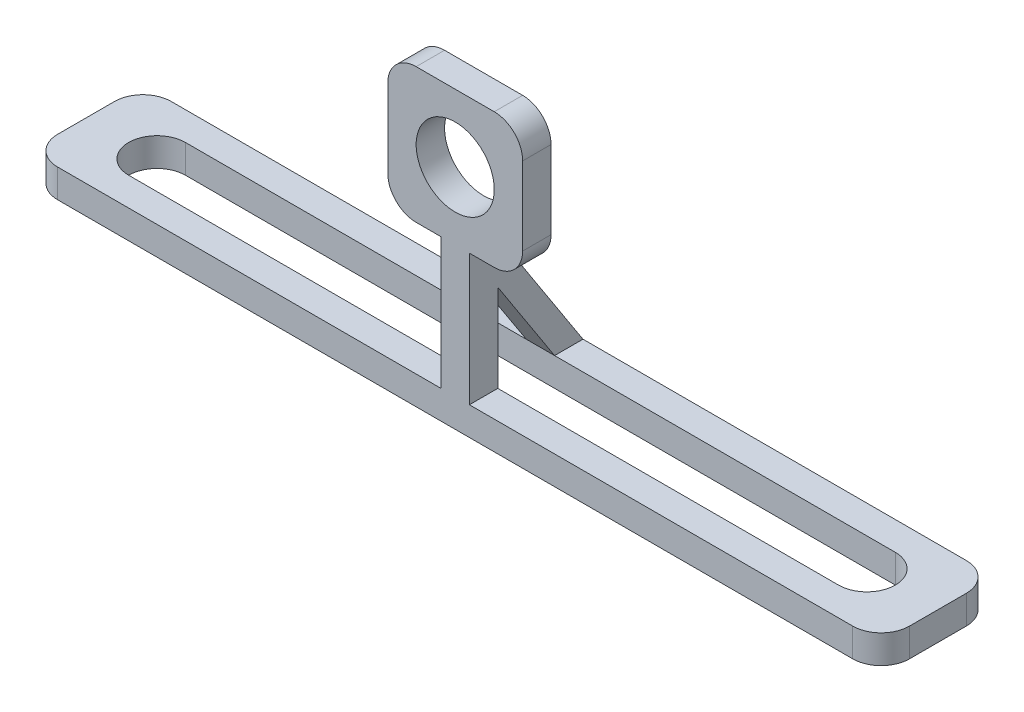
ISO-10303-21;
HEADER;
FILE_DESCRIPTION(('STEP AP214'),'2;1');
FILE_NAME('part.step','',(''),(''),'','','');
FILE_SCHEMA(('AUTOMOTIVE_DESIGN { 1 0 10303 214 1 1 1 1 }'));
ENDSEC;
DATA;
#1=APPLICATION_CONTEXT('core data for automotive mechanical design processes');
#2=APPLICATION_PROTOCOL_DEFINITION('international standard','automotive_design',2000,#1);
#3=PRODUCT_CONTEXT('',#1,'mechanical');
#4=PRODUCT('Part','Part','',(#3));
#5=PRODUCT_RELATED_PRODUCT_CATEGORY('part','',(#4));
#6=PRODUCT_DEFINITION_FORMATION('','',#4);
#7=PRODUCT_DEFINITION_CONTEXT('part definition',#1,'design');
#8=PRODUCT_DEFINITION('design','',#6,#7);
#9=PRODUCT_DEFINITION_SHAPE('','',#8);
#10=(LENGTH_UNIT() NAMED_UNIT(*) SI_UNIT(.MILLI.,.METRE.));
#11=(NAMED_UNIT(*) PLANE_ANGLE_UNIT() SI_UNIT($,.RADIAN.));
#12=(NAMED_UNIT(*) SI_UNIT($,.STERADIAN.) SOLID_ANGLE_UNIT());
#13=UNCERTAINTY_MEASURE_WITH_UNIT(LENGTH_MEASURE(1.E-05),#10,'distance_accuracy_value','');
#14=(GEOMETRIC_REPRESENTATION_CONTEXT(3) GLOBAL_UNCERTAINTY_ASSIGNED_CONTEXT((#13)) GLOBAL_UNIT_ASSIGNED_CONTEXT((#10,
#11,#12)) REPRESENTATION_CONTEXT('',''));
#15=CARTESIAN_POINT('',(0.,0.,0.));
#16=DIRECTION('',(0.,0.,1.));
#17=DIRECTION('',(1.,0.,0.));
#18=AXIS2_PLACEMENT_3D('',#15,#16,#17);
#19=CARTESIAN_POINT('',(0.,20.75,-1.99999999999999));
#20=DIRECTION('',(0.,0.,-1.));
#21=DIRECTION('',(-1.,0.,0.));
#22=AXIS2_PLACEMENT_3D('',#19,#20,#21);
#23=PLANE('',#22);
#24=DIRECTION('',(1.,0.,0.));
#25=VECTOR('',#24,1.);
#26=CARTESIAN_POINT('',(-1.,11.25,-1.99999999999999));
#27=LINE('',#26,#25);
#28=CARTESIAN_POINT('',(-1.,11.25,-1.99999999999999));
#29=VERTEX_POINT('',#28);
#30=CARTESIAN_POINT('',(1.,11.25,-1.99999999999999));
#31=VERTEX_POINT('',#30);
#32=EDGE_CURVE('E285',#29,#31,#27,.T.);
#33=ORIENTED_EDGE('',*,*,#32,.F.);
#34=DIRECTION('',(1.,0.,0.));
#35=VECTOR('',#34,1.);
#36=CARTESIAN_POINT('',(0.,11.25,-1.99999999999999));
#37=LINE('',#36,#35);
#38=CARTESIAN_POINT('',(-2.75,11.25,-1.99999999999999));
#39=VERTEX_POINT('',#38);
#40=EDGE_CURVE('E274',#39,#29,#37,.T.);
#41=ORIENTED_EDGE('',*,*,#40,.F.);
#42=CARTESIAN_POINT('',(-2.75,13.25,-1.99999999999999));
#43=DIRECTION('',(0.,0.,-1.));
#44=DIRECTION('',(-1.,0.,0.));
#45=AXIS2_PLACEMENT_3D('',#42,#43,#44);
#46=CIRCLE('',#45,2.);
#47=CARTESIAN_POINT('',(-4.75,13.25,-1.99999999999999));
#48=VERTEX_POINT('',#47);
#49=EDGE_CURVE('E442',#39,#48,#46,.T.);
#50=ORIENTED_EDGE('',*,*,#49,.T.);
#51=DIRECTION('',(0.,-1.,0.));
#52=VECTOR('',#51,1.);
#53=CARTESIAN_POINT('',(-4.75,20.75,-1.99999999999999));
#54=LINE('',#53,#52);
#55=CARTESIAN_POINT('',(-4.75,18.75,-1.99999999999999));
#56=VERTEX_POINT('',#55);
#57=EDGE_CURVE('E352',#56,#48,#54,.T.);
#58=ORIENTED_EDGE('',*,*,#57,.F.);
#59=CARTESIAN_POINT('',(-2.75,18.75,-1.99999999999999));
#60=DIRECTION('',(0.,0.,-1.));
#61=DIRECTION('',(-1.,0.,0.));
#62=AXIS2_PLACEMENT_3D('',#59,#60,#61);
#63=CIRCLE('',#62,2.);
#64=CARTESIAN_POINT('',(-2.75,20.75,-1.99999999999999));
#65=VERTEX_POINT('',#64);
#66=EDGE_CURVE('E438',#56,#65,#63,.T.);
#67=ORIENTED_EDGE('',*,*,#66,.T.);
#68=DIRECTION('',(1.,0.,0.));
#69=VECTOR('',#68,1.);
#70=CARTESIAN_POINT('',(0.,20.75,-1.99999999999999));
#71=LINE('',#70,#69);
#72=CARTESIAN_POINT('',(2.75,20.75,-1.99999999999999));
#73=VERTEX_POINT('',#72);
#74=EDGE_CURVE('E372',#65,#73,#71,.T.);
#75=ORIENTED_EDGE('',*,*,#74,.T.);
#76=CARTESIAN_POINT('',(2.75,18.75,-1.99999999999999));
#77=DIRECTION('',(0.,0.,-1.));
#78=DIRECTION('',(-1.,0.,0.));
#79=AXIS2_PLACEMENT_3D('',#76,#77,#78);
#80=CIRCLE('',#79,2.);
#81=CARTESIAN_POINT('',(4.75,18.75,-1.99999999999999));
#82=VERTEX_POINT('',#81);
#83=EDGE_CURVE('E436',#73,#82,#80,.T.);
#84=ORIENTED_EDGE('',*,*,#83,.T.);
#85=DIRECTION('',(0.,-1.,0.));
#86=VECTOR('',#85,1.);
#87=CARTESIAN_POINT('',(4.75,20.75,-1.99999999999999));
#88=LINE('',#87,#86);
#89=CARTESIAN_POINT('',(4.75,13.25,-1.99999999999999));
#90=VERTEX_POINT('',#89);
#91=EDGE_CURVE('E345',#82,#90,#88,.T.);
#92=ORIENTED_EDGE('',*,*,#91,.T.);
#93=CARTESIAN_POINT('',(2.75,13.25,-1.99999999999999));
#94=DIRECTION('',(0.,0.,-1.));
#95=DIRECTION('',(-1.,0.,0.));
#96=AXIS2_PLACEMENT_3D('',#93,#94,#95);
#97=CIRCLE('',#96,2.);
#98=CARTESIAN_POINT('',(2.75,11.25,-1.99999999999999));
#99=VERTEX_POINT('',#98);
#100=EDGE_CURVE('E440',#90,#99,#97,.T.);
#101=ORIENTED_EDGE('',*,*,#100,.T.);
#102=DIRECTION('',(-1.,0.,0.));
#103=VECTOR('',#102,1.);
#104=CARTESIAN_POINT('',(0.,11.25,-1.99999999999999));
#105=LINE('',#104,#103);
#106=EDGE_CURVE('E288',#99,#31,#105,.T.);
#107=ORIENTED_EDGE('',*,*,#106,.T.);
#108=EDGE_LOOP('',(#33,#41,#50,#58,#67,#75,#84,#92,#101,#107));
#109=FACE_BOUND('',#108,.T.);
#110=CARTESIAN_POINT('',(0.,16.,-1.99999999999999));
#111=DIRECTION('',(0.,0.,-1.));
#112=DIRECTION('',(-1.,0.,0.));
#113=AXIS2_PLACEMENT_3D('',#110,#111,#112);
#114=CIRCLE('',#113,2.75);
#115=CARTESIAN_POINT('',(-2.75,16.,-1.99999999999999));
#116=VERTEX_POINT('',#115);
#117=EDGE_CURVE('E361',#116,#116,#114,.T.);
#118=ORIENTED_EDGE('',*,*,#117,.F.);
#119=EDGE_LOOP('',(#118));
#120=FACE_BOUND('',#119,.T.);
#121=ADVANCED_FACE('F79',(#109,#120),#23,.T.);
#122=CARTESIAN_POINT('',(0.,2.,-20.75));
#123=DIRECTION('',(0.,-1.,0.));
#124=DIRECTION('',(1.,0.,0.));
#125=AXIS2_PLACEMENT_3D('',#122,#123,#124);
#126=PLANE('',#125);
#127=DIRECTION('',(0.,0.,-1.));
#128=VECTOR('',#127,1.);
#129=CARTESIAN_POINT('',(1.,1.99999999999999,-8.));
#130=LINE('',#129,#128);
#131=CARTESIAN_POINT('',(1.,2.,-5.99999999999999));
#132=VERTEX_POINT('',#131);
#133=CARTESIAN_POINT('',(1.,1.99999999999999,-8.));
#134=VERTEX_POINT('',#133);
#135=EDGE_CURVE('E309',#132,#134,#130,.T.);
#136=ORIENTED_EDGE('',*,*,#135,.F.);
#137=DIRECTION('',(-1.,0.,0.));
#138=VECTOR('',#137,1.);
#139=CARTESIAN_POINT('',(0.,2.,-5.99999999999999));
#140=LINE('',#139,#138);
#141=CARTESIAN_POINT('',(25.,2.,-6.));
#142=VERTEX_POINT('',#141);
#143=EDGE_CURVE('E364',#142,#132,#140,.T.);
#144=ORIENTED_EDGE('',*,*,#143,.F.);
#145=CARTESIAN_POINT('',(25.,2.,-4.));
#146=DIRECTION('',(0.,1.,0.));
#147=DIRECTION('',(-1.,0.,0.));
#148=AXIS2_PLACEMENT_3D('',#145,#146,#147);
#149=CIRCLE('',#148,2.);
#150=CARTESIAN_POINT('',(25.,2.,-1.99999999999999));
#151=VERTEX_POINT('',#150);
#152=EDGE_CURVE('E358',#151,#142,#149,.T.);
#153=ORIENTED_EDGE('',*,*,#152,.F.);
#154=DIRECTION('',(1.,0.,0.));
#155=VECTOR('',#154,1.);
#156=CARTESIAN_POINT('',(0.,2.,-1.99999999999999));
#157=LINE('',#156,#155);
#158=CARTESIAN_POINT('',(1.,2.,-1.99999999999999));
#159=VERTEX_POINT('',#158);
#160=EDGE_CURVE('E355',#159,#151,#157,.T.);
#161=ORIENTED_EDGE('',*,*,#160,.F.);
#162=DIRECTION('',(0.,0.,1.));
#163=VECTOR('',#162,1.);
#164=CARTESIAN_POINT('',(1.,2.,-20.75));
#165=LINE('',#164,#163);
#166=CARTESIAN_POINT('',(1.,2.,0.));
#167=VERTEX_POINT('',#166);
#168=EDGE_CURVE('E346',#159,#167,#165,.T.);
#169=ORIENTED_EDGE('',*,*,#168,.T.);
#170=DIRECTION('',(-1.,0.,0.));
#171=VECTOR('',#170,1.);
#172=CARTESIAN_POINT('',(0.,2.,0.));
#173=LINE('',#172,#171);
#174=CARTESIAN_POINT('',(28.,2.,0.));
#175=VERTEX_POINT('',#174);
#176=EDGE_CURVE('E339',#175,#167,#173,.T.);
#177=ORIENTED_EDGE('',*,*,#176,.F.);
#178=CARTESIAN_POINT('',(28.,2.,-2.));
#179=DIRECTION('',(0.,-1.,0.));
#180=DIRECTION('',(1.,0.,0.));
#181=AXIS2_PLACEMENT_3D('',#178,#179,#180);
#182=CIRCLE('',#181,2.);
#183=CARTESIAN_POINT('',(30.,2.,-2.));
#184=VERTEX_POINT('',#183);
#185=EDGE_CURVE('E476',#175,#184,#182,.F.);
#186=ORIENTED_EDGE('',*,*,#185,.T.);
#187=DIRECTION('',(0.,0.,1.));
#188=VECTOR('',#187,1.);
#189=CARTESIAN_POINT('',(30.,2.,-20.75));
#190=LINE('',#189,#188);
#191=CARTESIAN_POINT('',(30.,2.,-6.));
#192=VERTEX_POINT('',#191);
#193=EDGE_CURVE('E342',#192,#184,#190,.T.);
#194=ORIENTED_EDGE('',*,*,#193,.F.);
#195=CARTESIAN_POINT('',(28.,2.,-6.));
#196=DIRECTION('',(0.,-1.,0.));
#197=DIRECTION('',(1.,0.,0.));
#198=AXIS2_PLACEMENT_3D('',#195,#196,#197);
#199=CIRCLE('',#198,2.);
#200=CARTESIAN_POINT('',(28.,2.,-8.));
#201=VERTEX_POINT('',#200);
#202=EDGE_CURVE('E478',#192,#201,#199,.F.);
#203=ORIENTED_EDGE('',*,*,#202,.T.);
#204=DIRECTION('',(1.,0.,0.));
#205=VECTOR('',#204,1.);
#206=CARTESIAN_POINT('',(0.,2.,-7.99999999999999));
#207=LINE('',#206,#205);
#208=EDGE_CURVE('E367',#134,#201,#207,.T.);
#209=ORIENTED_EDGE('',*,*,#208,.F.);
#210=EDGE_LOOP('',(#136,#144,#153,#161,#169,#177,#186,#194,#203,#209));
#211=FACE_BOUND('',#210,.T.);
#212=ADVANCED_FACE('F505',(#211),#126,.F.);
#213=CARTESIAN_POINT('',(0.,20.75,-7.99999999999999));
#214=DIRECTION('',(0.,0.,1.));
#215=DIRECTION('',(1.,0.,0.));
#216=AXIS2_PLACEMENT_3D('',#213,#214,#215);
#217=PLANE('',#216);
#218=DIRECTION('',(-1.,0.,0.));
#219=VECTOR('',#218,1.);
#220=CARTESIAN_POINT('',(0.,0.,-7.99999999999999));
#221=LINE('',#220,#219);
#222=CARTESIAN_POINT('',(28.,0.,-8.));
#223=VERTEX_POINT('',#222);
#224=CARTESIAN_POINT('',(-28.,0.,-7.99999999999999));
#225=VERTEX_POINT('',#224);
#226=EDGE_CURVE('E391',#223,#225,#221,.T.);
#227=ORIENTED_EDGE('',*,*,#226,.T.);
#228=DIRECTION('',(0.,-1.,0.));
#229=VECTOR('',#228,1.);
#230=CARTESIAN_POINT('',(-28.,20.75,-7.99999999999999));
#231=LINE('',#230,#229);
#232=CARTESIAN_POINT('',(-28.,2.,-7.99999999999999));
#233=VERTEX_POINT('',#232);
#234=EDGE_CURVE('E472',#225,#233,#231,.F.);
#235=ORIENTED_EDGE('',*,*,#234,.T.);
#236=CARTESIAN_POINT('',(-0.999999999999999,2.,-7.99999999999999));
#237=VERTEX_POINT('',#236);
#238=EDGE_CURVE('E368',#233,#237,#207,.T.);
#239=ORIENTED_EDGE('',*,*,#238,.T.);
#240=DIRECTION('',(1.,0.,0.));
#241=VECTOR('',#240,1.);
#242=CARTESIAN_POINT('',(-0.999999999999999,1.99999999999999,-8.));
#243=LINE('',#242,#241);
#244=EDGE_CURVE('E294',#237,#134,#243,.T.);
#245=ORIENTED_EDGE('',*,*,#244,.T.);
#246=ORIENTED_EDGE('',*,*,#208,.T.);
#247=DIRECTION('',(0.,-1.,0.));
#248=VECTOR('',#247,1.);
#249=CARTESIAN_POINT('',(28.,20.75,-8.));
#250=LINE('',#249,#248);
#251=EDGE_CURVE('E469',#201,#223,#250,.T.);
#252=ORIENTED_EDGE('',*,*,#251,.T.);
#253=EDGE_LOOP('',(#227,#235,#239,#245,#246,#252));
#254=FACE_BOUND('',#253,.T.);
#255=ADVANCED_FACE('F501',(#254),#217,.F.);
#256=CARTESIAN_POINT('',(0.,20.75,0.));
#257=DIRECTION('',(0.,0.,-1.));
#258=DIRECTION('',(-1.,0.,0.));
#259=AXIS2_PLACEMENT_3D('',#256,#257,#258);
#260=PLANE('',#259);
#261=CARTESIAN_POINT('',(0.,16.,0.));
#262=DIRECTION('',(0.,0.,1.));
#263=DIRECTION('',(1.,0.,0.));
#264=AXIS2_PLACEMENT_3D('',#261,#262,#263);
#265=CIRCLE('',#264,2.75);
#266=CARTESIAN_POINT('',(2.75,16.,0.));
#267=VERTEX_POINT('',#266);
#268=EDGE_CURVE('E293',#267,#267,#265,.T.);
#269=ORIENTED_EDGE('',*,*,#268,.F.);
#270=EDGE_LOOP('',(#269));
#271=FACE_BOUND('',#270,.T.);
#272=DIRECTION('',(0.,1.,0.));
#273=VECTOR('',#272,1.);
#274=CARTESIAN_POINT('',(-4.75,0.,0.));
#275=LINE('',#274,#273);
#276=CARTESIAN_POINT('',(-4.75,13.25,0.));
#277=VERTEX_POINT('',#276);
#278=CARTESIAN_POINT('',(-4.75,18.75,0.));
#279=VERTEX_POINT('',#278);
#280=EDGE_CURVE('E324',#277,#279,#275,.T.);
#281=ORIENTED_EDGE('',*,*,#280,.F.);
#282=CARTESIAN_POINT('',(-2.75,13.25,0.));
#283=DIRECTION('',(0.,0.,-1.));
#284=DIRECTION('',(-1.,0.,0.));
#285=AXIS2_PLACEMENT_3D('',#282,#283,#284);
#286=CIRCLE('',#285,2.);
#287=CARTESIAN_POINT('',(-2.75,11.25,0.));
#288=VERTEX_POINT('',#287);
#289=EDGE_CURVE('E433',#277,#288,#286,.F.);
#290=ORIENTED_EDGE('',*,*,#289,.T.);
#291=DIRECTION('',(-1.,0.,0.));
#292=VECTOR('',#291,1.);
#293=CARTESIAN_POINT('',(0.,11.25,0.));
#294=LINE('',#293,#292);
#295=CARTESIAN_POINT('',(-1.,11.25,0.));
#296=VERTEX_POINT('',#295);
#297=EDGE_CURVE('E322',#296,#288,#294,.T.);
#298=ORIENTED_EDGE('',*,*,#297,.F.);
#299=DIRECTION('',(0.,-1.,0.));
#300=VECTOR('',#299,1.);
#301=CARTESIAN_POINT('',(-0.999999999999999,0.,0.));
#302=LINE('',#301,#300);
#303=CARTESIAN_POINT('',(-0.999999999999999,2.,0.));
#304=VERTEX_POINT('',#303);
#305=EDGE_CURVE('E266',#296,#304,#302,.T.);
#306=ORIENTED_EDGE('',*,*,#305,.T.);
#307=DIRECTION('',(1.,0.,0.));
#308=VECTOR('',#307,1.);
#309=CARTESIAN_POINT('',(0.,2.,0.));
#310=LINE('',#309,#308);
#311=CARTESIAN_POINT('',(-28.,2.,0.));
#312=VERTEX_POINT('',#311);
#313=EDGE_CURVE('E319',#312,#304,#310,.T.);
#314=ORIENTED_EDGE('',*,*,#313,.F.);
#315=DIRECTION('',(0.,-1.,0.));
#316=VECTOR('',#315,1.);
#317=CARTESIAN_POINT('',(-28.,20.75,0.));
#318=LINE('',#317,#316);
#319=CARTESIAN_POINT('',(-28.,0.,0.));
#320=VERTEX_POINT('',#319);
#321=EDGE_CURVE('E422',#312,#320,#318,.T.);
#322=ORIENTED_EDGE('',*,*,#321,.T.);
#323=DIRECTION('',(1.,0.,0.));
#324=VECTOR('',#323,1.);
#325=CARTESIAN_POINT('',(0.,0.,0.));
#326=LINE('',#325,#324);
#327=CARTESIAN_POINT('',(28.,0.,0.));
#328=VERTEX_POINT('',#327);
#329=EDGE_CURVE('E397',#320,#328,#326,.T.);
#330=ORIENTED_EDGE('',*,*,#329,.T.);
#331=DIRECTION('',(0.,-1.,0.));
#332=VECTOR('',#331,1.);
#333=CARTESIAN_POINT('',(28.,20.75,0.));
#334=LINE('',#333,#332);
#335=EDGE_CURVE('E425',#328,#175,#334,.F.);
#336=ORIENTED_EDGE('',*,*,#335,.T.);
#337=ORIENTED_EDGE('',*,*,#176,.T.);
#338=DIRECTION('',(0.,-1.,0.));
#339=VECTOR('',#338,1.);
#340=CARTESIAN_POINT('',(1.,0.,0.));
#341=LINE('',#340,#339);
#342=CARTESIAN_POINT('',(1.,11.25,0.));
#343=VERTEX_POINT('',#342);
#344=EDGE_CURVE('E336',#343,#167,#341,.T.);
#345=ORIENTED_EDGE('',*,*,#344,.F.);
#346=DIRECTION('',(1.,0.,0.));
#347=VECTOR('',#346,1.);
#348=CARTESIAN_POINT('',(0.,11.25,0.));
#349=LINE('',#348,#347);
#350=CARTESIAN_POINT('',(2.75,11.25,0.));
#351=VERTEX_POINT('',#350);
#352=EDGE_CURVE('E333',#343,#351,#349,.T.);
#353=ORIENTED_EDGE('',*,*,#352,.T.);
#354=CARTESIAN_POINT('',(2.75,13.25,0.));
#355=DIRECTION('',(0.,0.,-1.));
#356=DIRECTION('',(-1.,0.,0.));
#357=AXIS2_PLACEMENT_3D('',#354,#355,#356);
#358=CIRCLE('',#357,2.);
#359=CARTESIAN_POINT('',(4.75,13.25,0.));
#360=VERTEX_POINT('',#359);
#361=EDGE_CURVE('E431',#351,#360,#358,.F.);
#362=ORIENTED_EDGE('',*,*,#361,.T.);
#363=DIRECTION('',(0.,1.,0.));
#364=VECTOR('',#363,1.);
#365=CARTESIAN_POINT('',(4.75,0.,0.));
#366=LINE('',#365,#364);
#367=CARTESIAN_POINT('',(4.75,18.75,0.));
#368=VERTEX_POINT('',#367);
#369=EDGE_CURVE('E328',#360,#368,#366,.T.);
#370=ORIENTED_EDGE('',*,*,#369,.T.);
#371=CARTESIAN_POINT('',(2.75,18.75,0.));
#372=DIRECTION('',(0.,0.,-1.));
#373=DIRECTION('',(-1.,0.,0.));
#374=AXIS2_PLACEMENT_3D('',#371,#372,#373);
#375=CIRCLE('',#374,2.);
#376=CARTESIAN_POINT('',(2.75,20.75,0.));
#377=VERTEX_POINT('',#376);
#378=EDGE_CURVE('E427',#368,#377,#375,.F.);
#379=ORIENTED_EDGE('',*,*,#378,.T.);
#380=DIRECTION('',(1.,0.,0.));
#381=VECTOR('',#380,1.);
#382=CARTESIAN_POINT('',(0.,20.75,0.));
#383=LINE('',#382,#381);
#384=CARTESIAN_POINT('',(-2.75,20.75,0.));
#385=VERTEX_POINT('',#384);
#386=EDGE_CURVE('E375',#385,#377,#383,.T.);
#387=ORIENTED_EDGE('',*,*,#386,.F.);
#388=CARTESIAN_POINT('',(-2.75,18.75,0.));
#389=DIRECTION('',(0.,0.,-1.));
#390=DIRECTION('',(-1.,0.,0.));
#391=AXIS2_PLACEMENT_3D('',#388,#389,#390);
#392=CIRCLE('',#391,2.);
#393=EDGE_CURVE('E429',#385,#279,#392,.F.);
#394=ORIENTED_EDGE('',*,*,#393,.T.);
#395=EDGE_LOOP('',(#281,#290,#298,#306,#314,#322,#330,#336,#337,#345,#353,#362,#370,#379,#387,#394));
#396=FACE_BOUND('',#395,.T.);
#397=ADVANCED_FACE('F511',(#271,#396),#260,.F.);
#398=CARTESIAN_POINT('',(0.,20.75,-5.99999999999999));
#399=DIRECTION('',(0.,0.,-1.));
#400=DIRECTION('',(-1.,0.,0.));
#401=AXIS2_PLACEMENT_3D('',#398,#399,#400);
#402=PLANE('',#401);
#403=DIRECTION('',(0.,-1.,0.));
#404=VECTOR('',#403,1.);
#405=CARTESIAN_POINT('',(25.,20.75,-5.99999999999999));
#406=LINE('',#405,#404);
#407=CARTESIAN_POINT('',(25.,0.,-5.99999999999999));
#408=VERTEX_POINT('',#407);
#409=EDGE_CURVE('E405',#142,#408,#406,.T.);
#410=ORIENTED_EDGE('',*,*,#409,.F.);
#411=ORIENTED_EDGE('',*,*,#143,.T.);
#412=DIRECTION('',(1.,0.,0.));
#413=VECTOR('',#412,1.);
#414=CARTESIAN_POINT('',(-0.999999999999999,2.,-6.));
#415=LINE('',#414,#413);
#416=CARTESIAN_POINT('',(-0.999999999999999,2.,-5.99999999999999));
#417=VERTEX_POINT('',#416);
#418=EDGE_CURVE('E300',#417,#132,#415,.T.);
#419=ORIENTED_EDGE('',*,*,#418,.F.);
#420=CARTESIAN_POINT('',(-25.,2.,-5.99999999999999));
#421=VERTEX_POINT('',#420);
#422=EDGE_CURVE('E102',#417,#421,#140,.T.);
#423=ORIENTED_EDGE('',*,*,#422,.T.);
#424=DIRECTION('',(0.,-1.,0.));
#425=VECTOR('',#424,1.);
#426=CARTESIAN_POINT('',(-25.,20.75,-5.99999999999999));
#427=LINE('',#426,#425);
#428=CARTESIAN_POINT('',(-25.,0.,-5.99999999999999));
#429=VERTEX_POINT('',#428);
#430=EDGE_CURVE('E407',#421,#429,#427,.T.);
#431=ORIENTED_EDGE('',*,*,#430,.T.);
#432=DIRECTION('',(1.,0.,0.));
#433=VECTOR('',#432,1.);
#434=CARTESIAN_POINT('',(0.,0.,-5.99999999999999));
#435=LINE('',#434,#433);
#436=EDGE_CURVE('E382',#429,#408,#435,.T.);
#437=ORIENTED_EDGE('',*,*,#436,.T.);
#438=EDGE_LOOP('',(#410,#411,#419,#423,#431,#437));
#439=FACE_BOUND('',#438,.T.);
#440=ADVANCED_FACE('F562',(#439),#402,.F.);
#441=CARTESIAN_POINT('',(25.,20.75,-4.));
#442=DIRECTION('',(0.,-1.,0.));
#443=DIRECTION('',(0.,0.,-1.));
#444=AXIS2_PLACEMENT_3D('',#441,#442,#443);
#445=CYLINDRICAL_SURFACE('',#444,2.);
#446=DIRECTION('',(0.,-1.,0.));
#447=VECTOR('',#446,1.);
#448=CARTESIAN_POINT('',(25.,20.75,-1.99999999999999));
#449=LINE('',#448,#447);
#450=CARTESIAN_POINT('',(25.,0.,-1.99999999999999));
#451=VERTEX_POINT('',#450);
#452=EDGE_CURVE('E403',#151,#451,#449,.T.);
#453=ORIENTED_EDGE('',*,*,#452,.F.);
#454=ORIENTED_EDGE('',*,*,#152,.T.);
#455=ORIENTED_EDGE('',*,*,#409,.T.);
#456=CARTESIAN_POINT('',(25.,0.,-4.));
#457=DIRECTION('',(0.,1.,0.));
#458=DIRECTION('',(0.,0.,1.));
#459=AXIS2_PLACEMENT_3D('',#456,#457,#458);
#460=CIRCLE('',#459,2.);
#461=EDGE_CURVE('E385',#451,#408,#460,.T.);
#462=ORIENTED_EDGE('',*,*,#461,.F.);
#463=EDGE_LOOP('',(#453,#454,#455,#462));
#464=FACE_BOUND('',#463,.T.);
#465=ADVANCED_FACE('F590',(#464),#445,.F.);
#466=DIRECTION('',(1.,0.,0.));
#467=VECTOR('',#466,1.);
#468=CARTESIAN_POINT('',(-0.999999999999999,8.16666666666668,-1.99999999999999));
#469=LINE('',#468,#467);
#470=CARTESIAN_POINT('',(-0.999999999999999,8.16666666666668,-1.99999999999999));
#471=VERTEX_POINT('',#470);
#472=CARTESIAN_POINT('',(1.,8.16666666666668,-1.99999999999999));
#473=VERTEX_POINT('',#472);
#474=EDGE_CURVE('E94',#471,#473,#469,.T.);
#475=ORIENTED_EDGE('',*,*,#474,.T.);
#476=DIRECTION('',(0.,1.,0.));
#477=VECTOR('',#476,1.);
#478=CARTESIAN_POINT('',(0.999999999999999,20.75,-1.99999999999999));
#479=LINE('',#478,#477);
#480=EDGE_CURVE('E410',#159,#473,#479,.T.);
#481=ORIENTED_EDGE('',*,*,#480,.F.);
#482=ORIENTED_EDGE('',*,*,#160,.T.);
#483=ORIENTED_EDGE('',*,*,#452,.T.);
#484=DIRECTION('',(1.,0.,0.));
#485=VECTOR('',#484,1.);
#486=CARTESIAN_POINT('',(0.,0.,-1.99999999999999));
#487=LINE('',#486,#485);
#488=CARTESIAN_POINT('',(-25.,0.,-1.99999999999999));
#489=VERTEX_POINT('',#488);
#490=EDGE_CURVE('E388',#489,#451,#487,.T.);
#491=ORIENTED_EDGE('',*,*,#490,.F.);
#492=DIRECTION('',(0.,-1.,0.));
#493=VECTOR('',#492,1.);
#494=CARTESIAN_POINT('',(-25.,20.75,-1.99999999999999));
#495=LINE('',#494,#493);
#496=CARTESIAN_POINT('',(-25.,2.,-1.99999999999999));
#497=VERTEX_POINT('',#496);
#498=EDGE_CURVE('E379',#497,#489,#495,.T.);
#499=ORIENTED_EDGE('',*,*,#498,.F.);
#500=DIRECTION('',(-1.,0.,0.));
#501=VECTOR('',#500,1.);
#502=CARTESIAN_POINT('',(0.,2.,-1.99999999999999));
#503=LINE('',#502,#501);
#504=CARTESIAN_POINT('',(-0.999999999999999,2.,-1.99999999999999));
#505=VERTEX_POINT('',#504);
#506=EDGE_CURVE('E281',#505,#497,#503,.T.);
#507=ORIENTED_EDGE('',*,*,#506,.F.);
#508=DIRECTION('',(0.,1.,0.));
#509=VECTOR('',#508,1.);
#510=CARTESIAN_POINT('',(-1.,20.75,-1.99999999999999));
#511=LINE('',#510,#509);
#512=EDGE_CURVE('E282',#505,#471,#511,.T.);
#513=ORIENTED_EDGE('',*,*,#512,.T.);
#514=EDGE_LOOP('',(#475,#481,#482,#483,#491,#499,#507,#513));
#515=FACE_BOUND('',#514,.T.);
#516=ADVANCED_FACE('F581',(#515),#23,.T.);
#517=CARTESIAN_POINT('',(30.,20.75,0.));
#518=DIRECTION('',(-1.,0.,0.));
#519=DIRECTION('',(0.,0.,1.));
#520=AXIS2_PLACEMENT_3D('',#517,#518,#519);
#521=PLANE('',#520);
#522=DIRECTION('',(0.,0.,-1.));
#523=VECTOR('',#522,1.);
#524=CARTESIAN_POINT('',(30.,0.,0.));
#525=LINE('',#524,#523);
#526=CARTESIAN_POINT('',(30.,0.,-2.));
#527=VERTEX_POINT('',#526);
#528=CARTESIAN_POINT('',(30.,0.,-6.));
#529=VERTEX_POINT('',#528);
#530=EDGE_CURVE('E376',#527,#529,#525,.T.);
#531=ORIENTED_EDGE('',*,*,#530,.T.);
#532=DIRECTION('',(0.,-1.,0.));
#533=VECTOR('',#532,1.);
#534=CARTESIAN_POINT('',(30.,20.75,-6.));
#535=LINE('',#534,#533);
#536=EDGE_CURVE('E12',#529,#192,#535,.F.);
#537=ORIENTED_EDGE('',*,*,#536,.T.);
#538=ORIENTED_EDGE('',*,*,#193,.T.);
#539=DIRECTION('',(0.,-1.,0.));
#540=VECTOR('',#539,1.);
#541=CARTESIAN_POINT('',(30.,20.75,-2.));
#542=LINE('',#541,#540);
#543=EDGE_CURVE('E87',#184,#527,#542,.T.);
#544=ORIENTED_EDGE('',*,*,#543,.T.);
#545=EDGE_LOOP('',(#531,#537,#538,#544));
#546=FACE_BOUND('',#545,.T.);
#547=ADVANCED_FACE('F486',(#546),#521,.F.);
#548=CARTESIAN_POINT('',(0.,20.75,0.));
#549=DIRECTION('',(0.,1.,0.));
#550=DIRECTION('',(0.,0.,1.));
#551=AXIS2_PLACEMENT_3D('',#548,#549,#550);
#552=PLANE('',#551);
#553=ORIENTED_EDGE('',*,*,#74,.F.);
#554=DIRECTION('',(0.,0.,-1.));
#555=VECTOR('',#554,1.);
#556=CARTESIAN_POINT('',(-2.75,20.75,0.));
#557=LINE('',#556,#555);
#558=EDGE_CURVE('E454',#65,#385,#557,.F.);
#559=ORIENTED_EDGE('',*,*,#558,.T.);
#560=ORIENTED_EDGE('',*,*,#386,.T.);
#561=DIRECTION('',(0.,0.,-1.));
#562=VECTOR('',#561,1.);
#563=CARTESIAN_POINT('',(2.75,20.75,0.));
#564=LINE('',#563,#562);
#565=EDGE_CURVE('E451',#377,#73,#564,.T.);
#566=ORIENTED_EDGE('',*,*,#565,.T.);
#567=EDGE_LOOP('',(#553,#559,#560,#566));
#568=FACE_BOUND('',#567,.T.);
#569=ADVANCED_FACE('F537',(#568),#552,.T.);
#570=CARTESIAN_POINT('',(-30.,20.75,0.));
#571=DIRECTION('',(1.,0.,0.));
#572=DIRECTION('',(0.,0.,-1.));
#573=AXIS2_PLACEMENT_3D('',#570,#571,#572);
#574=PLANE('',#573);
#575=DIRECTION('',(0.,0.,1.));
#576=VECTOR('',#575,1.);
#577=CARTESIAN_POINT('',(-30.,2.,-20.75));
#578=LINE('',#577,#576);
#579=CARTESIAN_POINT('',(-30.,2.,-5.99999999999999));
#580=VERTEX_POINT('',#579);
#581=CARTESIAN_POINT('',(-30.,2.,-2.));
#582=VERTEX_POINT('',#581);
#583=EDGE_CURVE('E270',#580,#582,#578,.T.);
#584=ORIENTED_EDGE('',*,*,#583,.F.);
#585=DIRECTION('',(0.,-1.,0.));
#586=VECTOR('',#585,1.);
#587=CARTESIAN_POINT('',(-30.,20.75,-5.99999999999999));
#588=LINE('',#587,#586);
#589=CARTESIAN_POINT('',(-30.,0.,-5.99999999999999));
#590=VERTEX_POINT('',#589);
#591=EDGE_CURVE('E458',#580,#590,#588,.T.);
#592=ORIENTED_EDGE('',*,*,#591,.T.);
#593=DIRECTION('',(0.,0.,1.));
#594=VECTOR('',#593,1.);
#595=CARTESIAN_POINT('',(-30.,0.,0.));
#596=LINE('',#595,#594);
#597=CARTESIAN_POINT('',(-30.,0.,-2.));
#598=VERTEX_POINT('',#597);
#599=EDGE_CURVE('E394',#590,#598,#596,.T.);
#600=ORIENTED_EDGE('',*,*,#599,.T.);
#601=DIRECTION('',(0.,-1.,0.));
#602=VECTOR('',#601,1.);
#603=CARTESIAN_POINT('',(-30.,20.75,-2.));
#604=LINE('',#603,#602);
#605=EDGE_CURVE('E456',#598,#582,#604,.F.);
#606=ORIENTED_EDGE('',*,*,#605,.T.);
#607=EDGE_LOOP('',(#584,#592,#600,#606));
#608=FACE_BOUND('',#607,.T.);
#609=ADVANCED_FACE('F519',(#608),#574,.F.);
#610=CARTESIAN_POINT('',(-25.,20.75,-3.99999999999999));
#611=DIRECTION('',(0.,-1.,0.));
#612=DIRECTION('',(0.,0.,-1.));
#613=AXIS2_PLACEMENT_3D('',#610,#611,#612);
#614=CYLINDRICAL_SURFACE('',#613,2.);
#615=CARTESIAN_POINT('',(-25.,2.,-3.99999999999999));
#616=DIRECTION('',(0.,-1.,0.));
#617=DIRECTION('',(1.,0.,0.));
#618=AXIS2_PLACEMENT_3D('',#615,#616,#617);
#619=CIRCLE('',#618,2.);
#620=EDGE_CURVE('E362',#497,#421,#619,.T.);
#621=ORIENTED_EDGE('',*,*,#620,.F.);
#622=ORIENTED_EDGE('',*,*,#498,.T.);
#623=CARTESIAN_POINT('',(-25.,0.,-3.99999999999999));
#624=DIRECTION('',(0.,1.,0.));
#625=DIRECTION('',(0.,0.,1.));
#626=AXIS2_PLACEMENT_3D('',#623,#624,#625);
#627=CIRCLE('',#626,2.);
#628=EDGE_CURVE('E371',#429,#489,#627,.T.);
#629=ORIENTED_EDGE('',*,*,#628,.F.);
#630=ORIENTED_EDGE('',*,*,#430,.F.);
#631=EDGE_LOOP('',(#621,#622,#629,#630));
#632=FACE_BOUND('',#631,.T.);
#633=ADVANCED_FACE('F605',(#632),#614,.F.);
#634=CARTESIAN_POINT('',(0.,0.,0.));
#635=DIRECTION('',(0.,1.,0.));
#636=DIRECTION('',(0.,0.,1.));
#637=AXIS2_PLACEMENT_3D('',#634,#635,#636);
#638=PLANE('',#637);
#639=ORIENTED_EDGE('',*,*,#628,.T.);
#640=ORIENTED_EDGE('',*,*,#490,.T.);
#641=ORIENTED_EDGE('',*,*,#461,.T.);
#642=ORIENTED_EDGE('',*,*,#436,.F.);
#643=EDGE_LOOP('',(#639,#640,#641,#642));
#644=FACE_BOUND('',#643,.T.);
#645=ORIENTED_EDGE('',*,*,#599,.F.);
#646=CARTESIAN_POINT('',(-28.,0.,-5.99999999999999));
#647=DIRECTION('',(0.,1.,0.));
#648=DIRECTION('',(0.,0.,1.));
#649=AXIS2_PLACEMENT_3D('',#646,#647,#648);
#650=CIRCLE('',#649,2.);
#651=EDGE_CURVE('E467',#590,#225,#650,.F.);
#652=ORIENTED_EDGE('',*,*,#651,.T.);
#653=ORIENTED_EDGE('',*,*,#226,.F.);
#654=CARTESIAN_POINT('',(28.,0.,-6.));
#655=DIRECTION('',(0.,1.,0.));
#656=DIRECTION('',(0.,0.,1.));
#657=AXIS2_PLACEMENT_3D('',#654,#655,#656);
#658=CIRCLE('',#657,2.);
#659=EDGE_CURVE('E465',#223,#529,#658,.F.);
#660=ORIENTED_EDGE('',*,*,#659,.T.);
#661=ORIENTED_EDGE('',*,*,#530,.F.);
#662=CARTESIAN_POINT('',(28.,0.,-2.));
#663=DIRECTION('',(0.,1.,0.));
#664=DIRECTION('',(0.,0.,1.));
#665=AXIS2_PLACEMENT_3D('',#662,#663,#664);
#666=CIRCLE('',#665,2.);
#667=EDGE_CURVE('E463',#527,#328,#666,.F.);
#668=ORIENTED_EDGE('',*,*,#667,.T.);
#669=ORIENTED_EDGE('',*,*,#329,.F.);
#670=CARTESIAN_POINT('',(-28.,0.,-2.));
#671=DIRECTION('',(0.,1.,0.));
#672=DIRECTION('',(0.,0.,1.));
#673=AXIS2_PLACEMENT_3D('',#670,#671,#672);
#674=CIRCLE('',#673,2.);
#675=EDGE_CURVE('E461',#320,#598,#674,.F.);
#676=ORIENTED_EDGE('',*,*,#675,.T.);
#677=EDGE_LOOP('',(#645,#652,#653,#660,#661,#668,#669,#676));
#678=FACE_BOUND('',#677,.T.);
#679=ADVANCED_FACE('F493',(#644,#678),#638,.F.);
#680=CARTESIAN_POINT('',(4.75,0.,-20.75));
#681=DIRECTION('',(1.,0.,0.));
#682=DIRECTION('',(0.,0.,-1.));
#683=AXIS2_PLACEMENT_3D('',#680,#681,#682);
#684=PLANE('',#683);
#685=ORIENTED_EDGE('',*,*,#369,.F.);
#686=DIRECTION('',(0.,0.,1.));
#687=VECTOR('',#686,1.);
#688=CARTESIAN_POINT('',(4.75,13.25,-20.75));
#689=LINE('',#688,#687);
#690=EDGE_CURVE('E449',#360,#90,#689,.F.);
#691=ORIENTED_EDGE('',*,*,#690,.T.);
#692=ORIENTED_EDGE('',*,*,#91,.F.);
#693=DIRECTION('',(0.,0.,-1.));
#694=VECTOR('',#693,1.);
#695=CARTESIAN_POINT('',(4.75,18.75,-20.75));
#696=LINE('',#695,#694);
#697=EDGE_CURVE('E447',#82,#368,#696,.F.);
#698=ORIENTED_EDGE('',*,*,#697,.T.);
#699=EDGE_LOOP('',(#685,#691,#692,#698));
#700=FACE_BOUND('',#699,.T.);
#701=ADVANCED_FACE('F548',(#700),#684,.T.);
#702=CARTESIAN_POINT('',(1.,0.,-20.75));
#703=DIRECTION('',(-1.,0.,0.));
#704=DIRECTION('',(0.,-1.,0.));
#705=AXIS2_PLACEMENT_3D('',#702,#703,#704);
#706=PLANE('',#705);
#707=ORIENTED_EDGE('',*,*,#480,.T.);
#708=DIRECTION('',(0.,-0.838961287027659,-0.544191105099022));
#709=VECTOR('',#708,1.);
#710=CARTESIAN_POINT('',(1.,2.,-6.));
#711=LINE('',#710,#709);
#712=EDGE_CURVE('E306',#473,#132,#711,.T.);
#713=ORIENTED_EDGE('',*,*,#712,.T.);
#714=ORIENTED_EDGE('',*,*,#135,.T.);
#715=DIRECTION('',(0.,0.838961287027659,0.544191105099022));
#716=VECTOR('',#715,1.);
#717=CARTESIAN_POINT('',(1.,11.25,-1.99999999999999));
#718=LINE('',#717,#716);
#719=EDGE_CURVE('E312',#134,#31,#718,.T.);
#720=ORIENTED_EDGE('',*,*,#719,.T.);
#721=DIRECTION('',(0.,0.,1.));
#722=VECTOR('',#721,1.);
#723=CARTESIAN_POINT('',(1.,11.25,-20.75));
#724=LINE('',#723,#722);
#725=EDGE_CURVE('E341',#31,#343,#724,.T.);
#726=ORIENTED_EDGE('',*,*,#725,.T.);
#727=ORIENTED_EDGE('',*,*,#344,.T.);
#728=ORIENTED_EDGE('',*,*,#168,.F.);
#729=EDGE_LOOP('',(#707,#713,#714,#720,#726,#727,#728));
#730=FACE_BOUND('',#729,.T.);
#731=ADVANCED_FACE('F557',(#730),#706,.F.);
#732=CARTESIAN_POINT('',(0.,11.25,-20.75));
#733=DIRECTION('',(0.,-1.,0.));
#734=DIRECTION('',(0.,0.,-1.));
#735=AXIS2_PLACEMENT_3D('',#732,#733,#734);
#736=PLANE('',#735);
#737=ORIENTED_EDGE('',*,*,#106,.F.);
#738=DIRECTION('',(0.,0.,1.));
#739=VECTOR('',#738,1.);
#740=CARTESIAN_POINT('',(2.75,11.25,-20.75));
#741=LINE('',#740,#739);
#742=EDGE_CURVE('E444',#99,#351,#741,.T.);
#743=ORIENTED_EDGE('',*,*,#742,.T.);
#744=ORIENTED_EDGE('',*,*,#352,.F.);
#745=ORIENTED_EDGE('',*,*,#725,.F.);
#746=EDGE_LOOP('',(#737,#743,#744,#745));
#747=FACE_BOUND('',#746,.T.);
#748=ADVANCED_FACE('F554',(#747),#736,.T.);
#749=ORIENTED_EDGE('',*,*,#422,.F.);
#750=DIRECTION('',(0.,0.,-1.));
#751=VECTOR('',#750,1.);
#752=CARTESIAN_POINT('',(-0.999999999999999,1.99999999999999,-8.));
#753=LINE('',#752,#751);
#754=EDGE_CURVE('E298',#417,#237,#753,.T.);
#755=ORIENTED_EDGE('',*,*,#754,.T.);
#756=ORIENTED_EDGE('',*,*,#238,.F.);
#757=CARTESIAN_POINT('',(-28.,2.,-5.99999999999999));
#758=DIRECTION('',(0.,-1.,0.));
#759=DIRECTION('',(1.,0.,0.));
#760=AXIS2_PLACEMENT_3D('',#757,#758,#759);
#761=CIRCLE('',#760,2.);
#762=EDGE_CURVE('E481',#233,#580,#761,.F.);
#763=ORIENTED_EDGE('',*,*,#762,.T.);
#764=ORIENTED_EDGE('',*,*,#583,.T.);
#765=CARTESIAN_POINT('',(-28.,2.,-2.));
#766=DIRECTION('',(0.,-1.,0.));
#767=DIRECTION('',(1.,0.,0.));
#768=AXIS2_PLACEMENT_3D('',#765,#766,#767);
#769=CIRCLE('',#768,2.);
#770=EDGE_CURVE('E474',#582,#312,#769,.F.);
#771=ORIENTED_EDGE('',*,*,#770,.T.);
#772=ORIENTED_EDGE('',*,*,#313,.T.);
#773=DIRECTION('',(0.,0.,1.));
#774=VECTOR('',#773,1.);
#775=CARTESIAN_POINT('',(-0.999999999999999,2.,-20.75));
#776=LINE('',#775,#774);
#777=EDGE_CURVE('E271',#505,#304,#776,.T.);
#778=ORIENTED_EDGE('',*,*,#777,.F.);
#779=ORIENTED_EDGE('',*,*,#506,.T.);
#780=ORIENTED_EDGE('',*,*,#620,.T.);
#781=EDGE_LOOP('',(#749,#755,#756,#763,#764,#771,#772,#778,#779,#780));
#782=FACE_BOUND('',#781,.T.);
#783=ADVANCED_FACE('F522',(#782),#126,.F.);
#784=CARTESIAN_POINT('',(-4.75,0.,-20.75));
#785=DIRECTION('',(1.,0.,0.));
#786=DIRECTION('',(0.,0.,-1.));
#787=AXIS2_PLACEMENT_3D('',#784,#785,#786);
#788=PLANE('',#787);
#789=ORIENTED_EDGE('',*,*,#57,.T.);
#790=DIRECTION('',(0.,0.,1.));
#791=VECTOR('',#790,1.);
#792=CARTESIAN_POINT('',(-4.75,13.25,-20.75));
#793=LINE('',#792,#791);
#794=EDGE_CURVE('E419',#48,#277,#793,.T.);
#795=ORIENTED_EDGE('',*,*,#794,.T.);
#796=ORIENTED_EDGE('',*,*,#280,.T.);
#797=DIRECTION('',(0.,0.,-1.));
#798=VECTOR('',#797,1.);
#799=CARTESIAN_POINT('',(-4.75,18.75,-1.99999999999999));
#800=LINE('',#799,#798);
#801=EDGE_CURVE('E416',#279,#56,#800,.T.);
#802=ORIENTED_EDGE('',*,*,#801,.T.);
#803=EDGE_LOOP('',(#789,#795,#796,#802));
#804=FACE_BOUND('',#803,.T.);
#805=ADVANCED_FACE('F529',(#804),#788,.F.);
#806=CARTESIAN_POINT('',(0.,11.25,-20.75));
#807=DIRECTION('',(0.,1.,0.));
#808=DIRECTION('',(0.,0.,1.));
#809=AXIS2_PLACEMENT_3D('',#806,#807,#808);
#810=PLANE('',#809);
#811=ORIENTED_EDGE('',*,*,#297,.T.);
#812=DIRECTION('',(0.,0.,1.));
#813=VECTOR('',#812,1.);
#814=CARTESIAN_POINT('',(-2.75,11.25,-20.75));
#815=LINE('',#814,#813);
#816=EDGE_CURVE('E278',#288,#39,#815,.F.);
#817=ORIENTED_EDGE('',*,*,#816,.T.);
#818=ORIENTED_EDGE('',*,*,#40,.T.);
#819=DIRECTION('',(0.,0.,1.));
#820=VECTOR('',#819,1.);
#821=CARTESIAN_POINT('',(-1.,11.25,-20.75));
#822=LINE('',#821,#820);
#823=EDGE_CURVE('E258',#29,#296,#822,.T.);
#824=ORIENTED_EDGE('',*,*,#823,.T.);
#825=EDGE_LOOP('',(#811,#817,#818,#824));
#826=FACE_BOUND('',#825,.T.);
#827=ADVANCED_FACE('F276',(#826),#810,.F.);
#828=CARTESIAN_POINT('',(-0.999999999999999,0.,-20.75));
#829=DIRECTION('',(-1.,0.,0.));
#830=DIRECTION('',(0.,-1.,0.));
#831=AXIS2_PLACEMENT_3D('',#828,#829,#830);
#832=PLANE('',#831);
#833=ORIENTED_EDGE('',*,*,#777,.T.);
#834=ORIENTED_EDGE('',*,*,#305,.F.);
#835=ORIENTED_EDGE('',*,*,#823,.F.);
#836=DIRECTION('',(0.,0.838961287027659,0.544191105099022));
#837=VECTOR('',#836,1.);
#838=CARTESIAN_POINT('',(-1.,11.25,-1.99999999999999));
#839=LINE('',#838,#837);
#840=EDGE_CURVE('E264',#237,#29,#839,.T.);
#841=ORIENTED_EDGE('',*,*,#840,.F.);
#842=ORIENTED_EDGE('',*,*,#754,.F.);
#843=DIRECTION('',(0.,-0.838961287027659,-0.544191105099022));
#844=VECTOR('',#843,1.);
#845=CARTESIAN_POINT('',(-0.999999999999999,2.,-6.));
#846=LINE('',#845,#844);
#847=EDGE_CURVE('E302',#471,#417,#846,.T.);
#848=ORIENTED_EDGE('',*,*,#847,.F.);
#849=ORIENTED_EDGE('',*,*,#512,.F.);
#850=EDGE_LOOP('',(#833,#834,#835,#841,#842,#848,#849));
#851=FACE_BOUND('',#850,.T.);
#852=ADVANCED_FACE('F261',(#851),#832,.T.);
#853=CARTESIAN_POINT('',(0.,16.,-20.75));
#854=DIRECTION('',(0.,0.,1.));
#855=DIRECTION('',(1.,0.,0.));
#856=AXIS2_PLACEMENT_3D('',#853,#854,#855);
#857=CYLINDRICAL_SURFACE('',#856,2.75);
#858=ORIENTED_EDGE('',*,*,#117,.T.);
#859=EDGE_LOOP('',(#858));
#860=FACE_BOUND('',#859,.T.);
#861=ORIENTED_EDGE('',*,*,#268,.T.);
#862=EDGE_LOOP('',(#861));
#863=FACE_BOUND('',#862,.T.);
#864=ADVANCED_FACE('F611',(#860,#863),#857,.F.);
#865=CARTESIAN_POINT('',(-2.75,13.25,-20.75));
#866=DIRECTION('',(0.,0.,1.));
#867=DIRECTION('',(1.,0.,0.));
#868=AXIS2_PLACEMENT_3D('',#865,#866,#867);
#869=CYLINDRICAL_SURFACE('',#868,2.);
#870=ORIENTED_EDGE('',*,*,#49,.F.);
#871=ORIENTED_EDGE('',*,*,#816,.F.);
#872=ORIENTED_EDGE('',*,*,#289,.F.);
#873=ORIENTED_EDGE('',*,*,#794,.F.);
#874=EDGE_LOOP('',(#870,#871,#872,#873));
#875=FACE_BOUND('',#874,.T.);
#876=ADVANCED_FACE('F525',(#875),#869,.T.);
#877=CARTESIAN_POINT('',(2.75,13.25,-20.75));
#878=DIRECTION('',(0.,0.,1.));
#879=DIRECTION('',(1.,0.,0.));
#880=AXIS2_PLACEMENT_3D('',#877,#878,#879);
#881=CYLINDRICAL_SURFACE('',#880,2.);
#882=ORIENTED_EDGE('',*,*,#100,.F.);
#883=ORIENTED_EDGE('',*,*,#690,.F.);
#884=ORIENTED_EDGE('',*,*,#361,.F.);
#885=ORIENTED_EDGE('',*,*,#742,.F.);
#886=EDGE_LOOP('',(#882,#883,#884,#885));
#887=FACE_BOUND('',#886,.T.);
#888=ADVANCED_FACE('F551',(#887),#881,.T.);
#889=CARTESIAN_POINT('',(-2.75,18.75,-20.75));
#890=DIRECTION('',(0.,0.,1.));
#891=DIRECTION('',(1.,0.,0.));
#892=AXIS2_PLACEMENT_3D('',#889,#890,#891);
#893=CYLINDRICAL_SURFACE('',#892,2.);
#894=ORIENTED_EDGE('',*,*,#393,.F.);
#895=ORIENTED_EDGE('',*,*,#558,.F.);
#896=ORIENTED_EDGE('',*,*,#66,.F.);
#897=ORIENTED_EDGE('',*,*,#801,.F.);
#898=EDGE_LOOP('',(#894,#895,#896,#897));
#899=FACE_BOUND('',#898,.T.);
#900=ADVANCED_FACE('F533',(#899),#893,.T.);
#901=CARTESIAN_POINT('',(2.75,18.75,0.));
#902=DIRECTION('',(0.,0.,-1.));
#903=DIRECTION('',(-1.,0.,0.));
#904=AXIS2_PLACEMENT_3D('',#901,#902,#903);
#905=CYLINDRICAL_SURFACE('',#904,2.);
#906=ORIENTED_EDGE('',*,*,#378,.F.);
#907=ORIENTED_EDGE('',*,*,#697,.F.);
#908=ORIENTED_EDGE('',*,*,#83,.F.);
#909=ORIENTED_EDGE('',*,*,#565,.F.);
#910=EDGE_LOOP('',(#906,#907,#908,#909));
#911=FACE_BOUND('',#910,.T.);
#912=ADVANCED_FACE('F542',(#911),#905,.T.);
#913=CARTESIAN_POINT('',(-28.,20.75,-5.99999999999999));
#914=DIRECTION('',(0.,-1.,0.));
#915=DIRECTION('',(0.,0.,-1.));
#916=AXIS2_PLACEMENT_3D('',#913,#914,#915);
#917=CYLINDRICAL_SURFACE('',#916,2.);
#918=ORIENTED_EDGE('',*,*,#762,.F.);
#919=ORIENTED_EDGE('',*,*,#234,.F.);
#920=ORIENTED_EDGE('',*,*,#651,.F.);
#921=ORIENTED_EDGE('',*,*,#591,.F.);
#922=EDGE_LOOP('',(#918,#919,#920,#921));
#923=FACE_BOUND('',#922,.T.);
#924=ADVANCED_FACE('F570',(#923),#917,.T.);
#925=CARTESIAN_POINT('',(28.,20.75,-6.));
#926=DIRECTION('',(0.,-1.,0.));
#927=DIRECTION('',(0.,0.,-1.));
#928=AXIS2_PLACEMENT_3D('',#925,#926,#927);
#929=CYLINDRICAL_SURFACE('',#928,2.);
#930=ORIENTED_EDGE('',*,*,#202,.F.);
#931=ORIENTED_EDGE('',*,*,#536,.F.);
#932=ORIENTED_EDGE('',*,*,#659,.F.);
#933=ORIENTED_EDGE('',*,*,#251,.F.);
#934=EDGE_LOOP('',(#930,#931,#932,#933));
#935=FACE_BOUND('',#934,.T.);
#936=ADVANCED_FACE('F499',(#935),#929,.T.);
#937=CARTESIAN_POINT('',(28.,20.75,-2.));
#938=DIRECTION('',(0.,-1.,0.));
#939=DIRECTION('',(0.,0.,-1.));
#940=AXIS2_PLACEMENT_3D('',#937,#938,#939);
#941=CYLINDRICAL_SURFACE('',#940,2.);
#942=ORIENTED_EDGE('',*,*,#185,.F.);
#943=ORIENTED_EDGE('',*,*,#335,.F.);
#944=ORIENTED_EDGE('',*,*,#667,.F.);
#945=ORIENTED_EDGE('',*,*,#543,.F.);
#946=EDGE_LOOP('',(#942,#943,#944,#945));
#947=FACE_BOUND('',#946,.T.);
#948=ADVANCED_FACE('F508',(#947),#941,.T.);
#949=CARTESIAN_POINT('',(-28.,20.75,-2.));
#950=DIRECTION('',(0.,-1.,0.));
#951=DIRECTION('',(0.,0.,-1.));
#952=AXIS2_PLACEMENT_3D('',#949,#950,#951);
#953=CYLINDRICAL_SURFACE('',#952,2.);
#954=ORIENTED_EDGE('',*,*,#770,.F.);
#955=ORIENTED_EDGE('',*,*,#605,.F.);
#956=ORIENTED_EDGE('',*,*,#675,.F.);
#957=ORIENTED_EDGE('',*,*,#321,.F.);
#958=EDGE_LOOP('',(#954,#955,#956,#957));
#959=FACE_BOUND('',#958,.T.);
#960=ADVANCED_FACE('F81',(#959),#953,.T.);
#961=CARTESIAN_POINT('',(-1.,11.25,-1.99999999999999));
#962=DIRECTION('',(0.,0.544191105099022,-0.838961287027659));
#963=DIRECTION('',(0.,0.838961287027659,0.544191105099022));
#964=AXIS2_PLACEMENT_3D('',#961,#962,#963);
#965=PLANE('',#964);
#966=ORIENTED_EDGE('',*,*,#719,.F.);
#967=ORIENTED_EDGE('',*,*,#244,.F.);
#968=ORIENTED_EDGE('',*,*,#840,.T.);
#969=ORIENTED_EDGE('',*,*,#32,.T.);
#970=EDGE_LOOP('',(#966,#967,#968,#969));
#971=FACE_BOUND('',#970,.T.);
#972=ADVANCED_FACE('F297',(#971),#965,.T.);
#973=CARTESIAN_POINT('',(-0.999999999999999,2.,-6.));
#974=DIRECTION('',(0.,-0.544191105099022,0.838961287027659));
#975=DIRECTION('',(0.,-0.838961287027659,-0.544191105099022));
#976=AXIS2_PLACEMENT_3D('',#973,#974,#975);
#977=PLANE('',#976);
#978=ORIENTED_EDGE('',*,*,#712,.F.);
#979=ORIENTED_EDGE('',*,*,#474,.F.);
#980=ORIENTED_EDGE('',*,*,#847,.T.);
#981=ORIENTED_EDGE('',*,*,#418,.T.);
#982=EDGE_LOOP('',(#978,#979,#980,#981));
#983=FACE_BOUND('',#982,.T.);
#984=ADVANCED_FACE('F565',(#983),#977,.T.);
#985=CLOSED_SHELL('',(#121,#212,#255,#397,#440,#465,#516,#547,#569,#609,#633,#679,#701,#731,
#748,#783,#805,#827,#852,#864,#876,#888,#900,#912,#924,#936,#948,#960,#972,#984));
#986=MANIFOLD_SOLID_BREP('B2',#985);
#987=ADVANCED_BREP_SHAPE_REPRESENTATION('',(#18,#986),#14);
#988=SHAPE_DEFINITION_REPRESENTATION(#9,#987);
ENDSEC;
END-ISO-10303-21;
